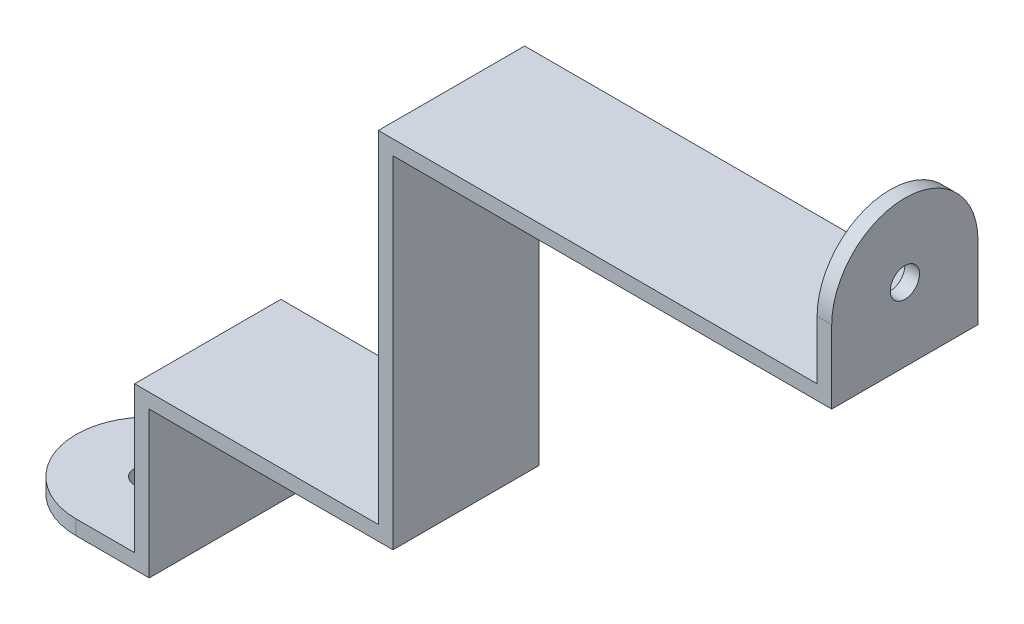
ISO-10303-21;
HEADER;
FILE_DESCRIPTION(('STEP AP214'),'2;1');
FILE_NAME('part.step','',(''),(''),'','','');
FILE_SCHEMA(('AUTOMOTIVE_DESIGN { 1 0 10303 214 1 1 1 1 }'));
ENDSEC;
DATA;
#1=APPLICATION_CONTEXT('core data for automotive mechanical design processes');
#2=APPLICATION_PROTOCOL_DEFINITION('international standard','automotive_design',2000,#1);
#3=PRODUCT_CONTEXT('',#1,'mechanical');
#4=PRODUCT('Part','Part','',(#3));
#5=PRODUCT_RELATED_PRODUCT_CATEGORY('part','',(#4));
#6=PRODUCT_DEFINITION_FORMATION('','',#4);
#7=PRODUCT_DEFINITION_CONTEXT('part definition',#1,'design');
#8=PRODUCT_DEFINITION('design','',#6,#7);
#9=PRODUCT_DEFINITION_SHAPE('','',#8);
#10=(LENGTH_UNIT() NAMED_UNIT(*) SI_UNIT(.MILLI.,.METRE.));
#11=(NAMED_UNIT(*) PLANE_ANGLE_UNIT() SI_UNIT($,.RADIAN.));
#12=(NAMED_UNIT(*) SI_UNIT($,.STERADIAN.) SOLID_ANGLE_UNIT());
#13=UNCERTAINTY_MEASURE_WITH_UNIT(LENGTH_MEASURE(1.E-05),#10,'distance_accuracy_value','');
#14=(GEOMETRIC_REPRESENTATION_CONTEXT(3) GLOBAL_UNCERTAINTY_ASSIGNED_CONTEXT((#13)) GLOBAL_UNIT_ASSIGNED_CONTEXT((#10,
#11,#12)) REPRESENTATION_CONTEXT('',''));
#15=CARTESIAN_POINT('',(0.,0.,0.));
#16=DIRECTION('',(0.,0.,1.));
#17=DIRECTION('',(1.,0.,0.));
#18=AXIS2_PLACEMENT_3D('',#15,#16,#17);
#19=CARTESIAN_POINT('',(-40.,-13.5,15.));
#20=DIRECTION('',(0.,-1.,0.));
#21=DIRECTION('',(0.,0.,-1.));
#22=AXIS2_PLACEMENT_3D('',#19,#20,#21);
#23=PLANE('',#22);
#24=CARTESIAN_POINT('',(-32.5,-13.5,7.5));
#25=DIRECTION('',(0.,1.,0.));
#26=DIRECTION('',(0.,0.,1.));
#27=AXIS2_PLACEMENT_3D('',#24,#25,#26);
#28=CIRCLE('',#27,1.5);
#29=CARTESIAN_POINT('',(-32.5,-13.5,9.));
#30=VERTEX_POINT('',#29);
#31=EDGE_CURVE('E516',#30,#30,#28,.T.);
#32=ORIENTED_EDGE('',*,*,#31,.F.);
#33=EDGE_LOOP('',(#32));
#34=FACE_BOUND('',#33,.T.);
#35=CARTESIAN_POINT('',(-32.5,-13.5,7.5));
#36=DIRECTION('',(0.,1.,0.));
#37=DIRECTION('',(0.,0.,1.));
#38=AXIS2_PLACEMENT_3D('',#35,#36,#37);
#39=CIRCLE('',#38,7.5);
#40=CARTESIAN_POINT('',(-32.5,-13.5,0.));
#41=VERTEX_POINT('',#40);
#42=CARTESIAN_POINT('',(-32.5,-13.5,15.));
#43=VERTEX_POINT('',#42);
#44=EDGE_CURVE('E200',#41,#43,#39,.T.);
#45=ORIENTED_EDGE('',*,*,#44,.T.);
#46=DIRECTION('',(-1.,0.,0.));
#47=VECTOR('',#46,1.);
#48=CARTESIAN_POINT('',(-40.,-13.5,15.));
#49=LINE('',#48,#47);
#50=CARTESIAN_POINT('',(-26.5,-13.5,15.));
#51=VERTEX_POINT('',#50);
#52=EDGE_CURVE('E203',#51,#43,#49,.T.);
#53=ORIENTED_EDGE('',*,*,#52,.F.);
#54=DIRECTION('',(0.,0.,-1.));
#55=VECTOR('',#54,1.);
#56=CARTESIAN_POINT('',(-26.5,-13.5,15.));
#57=LINE('',#56,#55);
#58=CARTESIAN_POINT('',(-26.5,-13.5,0.));
#59=VERTEX_POINT('',#58);
#60=EDGE_CURVE('E259',#51,#59,#57,.T.);
#61=ORIENTED_EDGE('',*,*,#60,.T.);
#62=DIRECTION('',(-1.,0.,0.));
#63=VECTOR('',#62,1.);
#64=CARTESIAN_POINT('',(-40.,-13.5,0.));
#65=LINE('',#64,#63);
#66=EDGE_CURVE('E205',#59,#41,#65,.T.);
#67=ORIENTED_EDGE('',*,*,#66,.T.);
#68=EDGE_LOOP('',(#45,#53,#61,#67));
#69=FACE_BOUND('',#68,.T.);
#70=ADVANCED_FACE('F98',(#34,#69),#23,.F.);
#71=CARTESIAN_POINT('',(-25.,-15.,15.));
#72=DIRECTION('',(0.,1.,0.));
#73=DIRECTION('',(-1.,0.,0.));
#74=AXIS2_PLACEMENT_3D('',#71,#72,#73);
#75=PLANE('',#74);
#76=CARTESIAN_POINT('',(-32.5,-15.,7.5));
#77=DIRECTION('',(0.,1.,0.));
#78=DIRECTION('',(-1.,0.,0.));
#79=AXIS2_PLACEMENT_3D('',#76,#77,#78);
#80=CIRCLE('',#79,1.5);
#81=CARTESIAN_POINT('',(-34.,-15.,7.5));
#82=VERTEX_POINT('',#81);
#83=EDGE_CURVE('E102',#82,#82,#80,.T.);
#84=ORIENTED_EDGE('',*,*,#83,.T.);
#85=EDGE_LOOP('',(#84));
#86=FACE_BOUND('',#85,.T.);
#87=DIRECTION('',(1.,0.,0.));
#88=VECTOR('',#87,1.);
#89=CARTESIAN_POINT('',(-25.,-15.,15.));
#90=LINE('',#89,#88);
#91=CARTESIAN_POINT('',(-32.5,-15.,15.));
#92=VERTEX_POINT('',#91);
#93=CARTESIAN_POINT('',(-25.,-15.,15.));
#94=VERTEX_POINT('',#93);
#95=EDGE_CURVE('E215',#92,#94,#90,.T.);
#96=ORIENTED_EDGE('',*,*,#95,.F.);
#97=CARTESIAN_POINT('',(-32.5,-15.,7.5));
#98=DIRECTION('',(0.,1.,0.));
#99=DIRECTION('',(-1.,0.,0.));
#100=AXIS2_PLACEMENT_3D('',#97,#98,#99);
#101=CIRCLE('',#100,7.5);
#102=CARTESIAN_POINT('',(-32.5,-15.,0.));
#103=VERTEX_POINT('',#102);
#104=EDGE_CURVE('E107',#103,#92,#101,.T.);
#105=ORIENTED_EDGE('',*,*,#104,.F.);
#106=DIRECTION('',(1.,0.,0.));
#107=VECTOR('',#106,1.);
#108=CARTESIAN_POINT('',(-25.,-15.,0.));
#109=LINE('',#108,#107);
#110=CARTESIAN_POINT('',(-25.,-15.,0.));
#111=VERTEX_POINT('',#110);
#112=EDGE_CURVE('E249',#103,#111,#109,.T.);
#113=ORIENTED_EDGE('',*,*,#112,.T.);
#114=DIRECTION('',(0.,0.,-1.));
#115=VECTOR('',#114,1.);
#116=CARTESIAN_POINT('',(-25.,-15.,15.));
#117=LINE('',#116,#115);
#118=EDGE_CURVE('E256',#94,#111,#117,.T.);
#119=ORIENTED_EDGE('',*,*,#118,.F.);
#120=EDGE_LOOP('',(#96,#105,#113,#119));
#121=FACE_BOUND('',#120,.T.);
#122=ADVANCED_FACE('F357',(#86,#121),#75,.F.);
#123=CARTESIAN_POINT('',(45.,35.,15.));
#124=DIRECTION('',(-1.,0.,0.));
#125=DIRECTION('',(0.,0.,1.));
#126=AXIS2_PLACEMENT_3D('',#123,#124,#125);
#127=PLANE('',#126);
#128=CARTESIAN_POINT('',(45.,42.5,7.5));
#129=DIRECTION('',(-1.,0.,0.));
#130=DIRECTION('',(0.,0.,1.));
#131=AXIS2_PLACEMENT_3D('',#128,#129,#130);
#132=CIRCLE('',#131,1.5);
#133=CARTESIAN_POINT('',(45.,42.5,9.));
#134=VERTEX_POINT('',#133);
#135=EDGE_CURVE('E229',#134,#134,#132,.T.);
#136=ORIENTED_EDGE('',*,*,#135,.T.);
#137=EDGE_LOOP('',(#136));
#138=FACE_BOUND('',#137,.T.);
#139=CARTESIAN_POINT('',(45.,42.5,7.5));
#140=DIRECTION('',(-1.,0.,0.));
#141=DIRECTION('',(0.,0.,1.));
#142=AXIS2_PLACEMENT_3D('',#139,#140,#141);
#143=CIRCLE('',#142,7.5);
#144=CARTESIAN_POINT('',(45.,42.5,15.));
#145=VERTEX_POINT('',#144);
#146=CARTESIAN_POINT('',(45.,42.5,0.));
#147=VERTEX_POINT('',#146);
#148=EDGE_CURVE('E122',#145,#147,#143,.T.);
#149=ORIENTED_EDGE('',*,*,#148,.F.);
#150=DIRECTION('',(0.,1.,0.));
#151=VECTOR('',#150,1.);
#152=CARTESIAN_POINT('',(45.,35.,15.));
#153=LINE('',#152,#151);
#154=CARTESIAN_POINT('',(45.,35.,15.));
#155=VERTEX_POINT('',#154);
#156=EDGE_CURVE('E292',#155,#145,#153,.T.);
#157=ORIENTED_EDGE('',*,*,#156,.F.);
#158=DIRECTION('',(0.,0.,-1.));
#159=VECTOR('',#158,1.);
#160=CARTESIAN_POINT('',(45.,35.,15.));
#161=LINE('',#160,#159);
#162=CARTESIAN_POINT('',(45.,35.,0.));
#163=VERTEX_POINT('',#162);
#164=EDGE_CURVE('E273',#155,#163,#161,.T.);
#165=ORIENTED_EDGE('',*,*,#164,.T.);
#166=DIRECTION('',(0.,1.,0.));
#167=VECTOR('',#166,1.);
#168=CARTESIAN_POINT('',(45.,35.,0.));
#169=LINE('',#168,#167);
#170=EDGE_CURVE('E233',#163,#147,#169,.T.);
#171=ORIENTED_EDGE('',*,*,#170,.T.);
#172=EDGE_LOOP('',(#149,#157,#165,#171));
#173=FACE_BOUND('',#172,.T.);
#174=ADVANCED_FACE('F341',(#138,#173),#127,.F.);
#175=CARTESIAN_POINT('',(43.5,50.,15.));
#176=DIRECTION('',(1.,0.,0.));
#177=DIRECTION('',(0.,0.,-1.));
#178=AXIS2_PLACEMENT_3D('',#175,#176,#177);
#179=PLANE('',#178);
#180=CARTESIAN_POINT('',(43.5,42.5,7.5));
#181=DIRECTION('',(-1.,0.,0.));
#182=DIRECTION('',(0.,0.,1.));
#183=AXIS2_PLACEMENT_3D('',#180,#181,#182);
#184=CIRCLE('',#183,1.5);
#185=CARTESIAN_POINT('',(43.5,42.5,9.));
#186=VERTEX_POINT('',#185);
#187=EDGE_CURVE('E325',#186,#186,#184,.T.);
#188=ORIENTED_EDGE('',*,*,#187,.F.);
#189=EDGE_LOOP('',(#188));
#190=FACE_BOUND('',#189,.T.);
#191=DIRECTION('',(0.,-1.,0.));
#192=VECTOR('',#191,1.);
#193=CARTESIAN_POINT('',(43.5,50.,15.));
#194=LINE('',#193,#192);
#195=CARTESIAN_POINT('',(43.5,42.5,15.));
#196=VERTEX_POINT('',#195);
#197=CARTESIAN_POINT('',(43.5,36.5,15.));
#198=VERTEX_POINT('',#197);
#199=EDGE_CURVE('E289',#196,#198,#194,.T.);
#200=ORIENTED_EDGE('',*,*,#199,.F.);
#201=CARTESIAN_POINT('',(43.5,42.5,7.5));
#202=DIRECTION('',(-1.,0.,0.));
#203=DIRECTION('',(0.,0.,1.));
#204=AXIS2_PLACEMENT_3D('',#201,#202,#203);
#205=CIRCLE('',#204,7.5);
#206=CARTESIAN_POINT('',(43.5,42.5,0.));
#207=VERTEX_POINT('',#206);
#208=EDGE_CURVE('E296',#196,#207,#205,.T.);
#209=ORIENTED_EDGE('',*,*,#208,.T.);
#210=DIRECTION('',(0.,-1.,0.));
#211=VECTOR('',#210,1.);
#212=CARTESIAN_POINT('',(43.5,50.,0.));
#213=LINE('',#212,#211);
#214=CARTESIAN_POINT('',(43.5,36.5,0.));
#215=VERTEX_POINT('',#214);
#216=EDGE_CURVE('E236',#207,#215,#213,.T.);
#217=ORIENTED_EDGE('',*,*,#216,.T.);
#218=DIRECTION('',(0.,0.,-1.));
#219=VECTOR('',#218,1.);
#220=CARTESIAN_POINT('',(43.5,36.5,15.));
#221=LINE('',#220,#219);
#222=EDGE_CURVE('E270',#198,#215,#221,.T.);
#223=ORIENTED_EDGE('',*,*,#222,.F.);
#224=EDGE_LOOP('',(#200,#209,#217,#223));
#225=FACE_BOUND('',#224,.T.);
#226=ADVANCED_FACE('F295',(#190,#225),#179,.F.);
#227=CARTESIAN_POINT('',(0.,0.,15.));
#228=DIRECTION('',(0.,0.,1.));
#229=DIRECTION('',(1.,0.,0.));
#230=AXIS2_PLACEMENT_3D('',#227,#228,#229);
#231=PLANE('',#230);
#232=DIRECTION('',(0.,1.,0.));
#233=VECTOR('',#232,1.);
#234=CARTESIAN_POINT('',(-32.5,-23.5,15.));
#235=LINE('',#234,#233);
#236=EDGE_CURVE('E12',#92,#43,#235,.T.);
#237=ORIENTED_EDGE('',*,*,#236,.F.);
#238=ORIENTED_EDGE('',*,*,#95,.T.);
#239=DIRECTION('',(0.,1.,0.));
#240=VECTOR('',#239,1.);
#241=CARTESIAN_POINT('',(-25.,0.,15.));
#242=LINE('',#241,#240);
#243=CARTESIAN_POINT('',(-25.,0.,15.));
#244=VERTEX_POINT('',#243);
#245=EDGE_CURVE('E217',#94,#244,#242,.T.);
#246=ORIENTED_EDGE('',*,*,#245,.T.);
#247=DIRECTION('',(1.,0.,0.));
#248=VECTOR('',#247,1.);
#249=CARTESIAN_POINT('',(0.,0.,15.));
#250=LINE('',#249,#248);
#251=CARTESIAN_POINT('',(0.,0.,15.));
#252=VERTEX_POINT('',#251);
#253=EDGE_CURVE('E253',#244,#252,#250,.T.);
#254=ORIENTED_EDGE('',*,*,#253,.T.);
#255=DIRECTION('',(0.,1.,0.));
#256=VECTOR('',#255,1.);
#257=CARTESIAN_POINT('',(0.,0.,15.));
#258=LINE('',#257,#256);
#259=CARTESIAN_POINT('',(0.,35.,15.));
#260=VERTEX_POINT('',#259);
#261=EDGE_CURVE('E332',#252,#260,#258,.T.);
#262=ORIENTED_EDGE('',*,*,#261,.T.);
#263=DIRECTION('',(1.,0.,0.));
#264=VECTOR('',#263,1.);
#265=CARTESIAN_POINT('',(0.,35.,15.));
#266=LINE('',#265,#264);
#267=EDGE_CURVE('E303',#260,#155,#266,.T.);
#268=ORIENTED_EDGE('',*,*,#267,.T.);
#269=ORIENTED_EDGE('',*,*,#156,.T.);
#270=DIRECTION('',(-1.,0.,0.));
#271=VECTOR('',#270,1.);
#272=CARTESIAN_POINT('',(53.5,42.5,15.));
#273=LINE('',#272,#271);
#274=EDGE_CURVE('E284',#145,#196,#273,.T.);
#275=ORIENTED_EDGE('',*,*,#274,.T.);
#276=ORIENTED_EDGE('',*,*,#199,.T.);
#277=DIRECTION('',(-1.,0.,0.));
#278=VECTOR('',#277,1.);
#279=CARTESIAN_POINT('',(43.5,36.5,15.));
#280=LINE('',#279,#278);
#281=CARTESIAN_POINT('',(-1.49999999999999,36.5,15.));
#282=VERTEX_POINT('',#281);
#283=EDGE_CURVE('E299',#198,#282,#280,.T.);
#284=ORIENTED_EDGE('',*,*,#283,.T.);
#285=DIRECTION('',(0.,-1.,0.));
#286=VECTOR('',#285,1.);
#287=CARTESIAN_POINT('',(-1.49999999999999,36.5,15.));
#288=LINE('',#287,#286);
#289=CARTESIAN_POINT('',(-1.49999999999999,1.49999999999999,15.));
#290=VERTEX_POINT('',#289);
#291=EDGE_CURVE('E301',#282,#290,#288,.T.);
#292=ORIENTED_EDGE('',*,*,#291,.T.);
#293=DIRECTION('',(-1.,0.,0.));
#294=VECTOR('',#293,1.);
#295=CARTESIAN_POINT('',(-1.49999999999999,1.49999999999999,15.));
#296=LINE('',#295,#294);
#297=CARTESIAN_POINT('',(-26.5,1.49999999999999,15.));
#298=VERTEX_POINT('',#297);
#299=EDGE_CURVE('E219',#290,#298,#296,.T.);
#300=ORIENTED_EDGE('',*,*,#299,.T.);
#301=DIRECTION('',(0.,-1.,0.));
#302=VECTOR('',#301,1.);
#303=CARTESIAN_POINT('',(-26.5,-13.5,15.));
#304=LINE('',#303,#302);
#305=EDGE_CURVE('E213',#298,#51,#304,.T.);
#306=ORIENTED_EDGE('',*,*,#305,.T.);
#307=ORIENTED_EDGE('',*,*,#52,.T.);
#308=EDGE_LOOP('',(#237,#238,#246,#254,#262,#268,#269,#275,#276,#284,#292,#300,#306,#307));
#309=FACE_BOUND('',#308,.T.);
#310=ADVANCED_FACE('F211',(#309),#231,.T.);
#311=CARTESIAN_POINT('',(0.,0.,0.));
#312=DIRECTION('',(0.,0.,1.));
#313=DIRECTION('',(1.,0.,0.));
#314=AXIS2_PLACEMENT_3D('',#311,#312,#313);
#315=PLANE('',#314);
#316=ORIENTED_EDGE('',*,*,#112,.F.);
#317=DIRECTION('',(0.,1.,0.));
#318=VECTOR('',#317,1.);
#319=CARTESIAN_POINT('',(-32.5,-23.5,0.));
#320=LINE('',#319,#318);
#321=EDGE_CURVE('E114',#103,#41,#320,.T.);
#322=ORIENTED_EDGE('',*,*,#321,.T.);
#323=ORIENTED_EDGE('',*,*,#66,.F.);
#324=DIRECTION('',(0.,-1.,0.));
#325=VECTOR('',#324,1.);
#326=CARTESIAN_POINT('',(-26.5,-13.5,0.));
#327=LINE('',#326,#325);
#328=CARTESIAN_POINT('',(-26.5,1.49999999999999,0.));
#329=VERTEX_POINT('',#328);
#330=EDGE_CURVE('E246',#329,#59,#327,.T.);
#331=ORIENTED_EDGE('',*,*,#330,.F.);
#332=DIRECTION('',(-1.,0.,0.));
#333=VECTOR('',#332,1.);
#334=CARTESIAN_POINT('',(-26.5,1.49999999999999,0.));
#335=LINE('',#334,#333);
#336=CARTESIAN_POINT('',(-1.49999999999999,1.49999999999999,0.));
#337=VERTEX_POINT('',#336);
#338=EDGE_CURVE('E244',#337,#329,#335,.T.);
#339=ORIENTED_EDGE('',*,*,#338,.F.);
#340=DIRECTION('',(0.,-1.,0.));
#341=VECTOR('',#340,1.);
#342=CARTESIAN_POINT('',(-1.49999999999999,35.,0.));
#343=LINE('',#342,#341);
#344=CARTESIAN_POINT('',(-1.49999999999999,36.5,0.));
#345=VERTEX_POINT('',#344);
#346=EDGE_CURVE('E241',#345,#337,#343,.T.);
#347=ORIENTED_EDGE('',*,*,#346,.F.);
#348=DIRECTION('',(-1.,0.,0.));
#349=VECTOR('',#348,1.);
#350=CARTESIAN_POINT('',(43.5,36.5,0.));
#351=LINE('',#350,#349);
#352=EDGE_CURVE('E238',#215,#345,#351,.T.);
#353=ORIENTED_EDGE('',*,*,#352,.F.);
#354=ORIENTED_EDGE('',*,*,#216,.F.);
#355=DIRECTION('',(-1.,0.,0.));
#356=VECTOR('',#355,1.);
#357=CARTESIAN_POINT('',(53.5,42.5,0.));
#358=LINE('',#357,#356);
#359=EDGE_CURVE('E282',#147,#207,#358,.T.);
#360=ORIENTED_EDGE('',*,*,#359,.F.);
#361=ORIENTED_EDGE('',*,*,#170,.F.);
#362=DIRECTION('',(1.,0.,0.));
#363=VECTOR('',#362,1.);
#364=CARTESIAN_POINT('',(0.,35.,0.));
#365=LINE('',#364,#363);
#366=CARTESIAN_POINT('',(0.,35.,0.));
#367=VERTEX_POINT('',#366);
#368=EDGE_CURVE('E231',#367,#163,#365,.T.);
#369=ORIENTED_EDGE('',*,*,#368,.F.);
#370=DIRECTION('',(0.,1.,0.));
#371=VECTOR('',#370,1.);
#372=CARTESIAN_POINT('',(0.,0.,0.));
#373=LINE('',#372,#371);
#374=CARTESIAN_POINT('',(0.,0.,0.));
#375=VERTEX_POINT('',#374);
#376=EDGE_CURVE('E228',#375,#367,#373,.T.);
#377=ORIENTED_EDGE('',*,*,#376,.F.);
#378=DIRECTION('',(1.,0.,0.));
#379=VECTOR('',#378,1.);
#380=CARTESIAN_POINT('',(0.,0.,0.));
#381=LINE('',#380,#379);
#382=CARTESIAN_POINT('',(-25.,0.,0.));
#383=VERTEX_POINT('',#382);
#384=EDGE_CURVE('E225',#383,#375,#381,.T.);
#385=ORIENTED_EDGE('',*,*,#384,.F.);
#386=DIRECTION('',(0.,1.,0.));
#387=VECTOR('',#386,1.);
#388=CARTESIAN_POINT('',(-25.,0.,0.));
#389=LINE('',#388,#387);
#390=EDGE_CURVE('E251',#111,#383,#389,.T.);
#391=ORIENTED_EDGE('',*,*,#390,.F.);
#392=EDGE_LOOP('',(#316,#322,#323,#331,#339,#347,#353,#354,#360,#361,#369,#377,#385,#391));
#393=FACE_BOUND('',#392,.T.);
#394=ADVANCED_FACE('F318',(#393),#315,.F.);
#395=CARTESIAN_POINT('',(0.,0.,15.));
#396=DIRECTION('',(0.,1.,0.));
#397=DIRECTION('',(-1.,0.,0.));
#398=AXIS2_PLACEMENT_3D('',#395,#396,#397);
#399=PLANE('',#398);
#400=ORIENTED_EDGE('',*,*,#384,.T.);
#401=DIRECTION('',(0.,0.,-1.));
#402=VECTOR('',#401,1.);
#403=CARTESIAN_POINT('',(0.,0.,15.));
#404=LINE('',#403,#402);
#405=EDGE_CURVE('E279',#252,#375,#404,.T.);
#406=ORIENTED_EDGE('',*,*,#405,.F.);
#407=ORIENTED_EDGE('',*,*,#253,.F.);
#408=DIRECTION('',(0.,0.,-1.));
#409=VECTOR('',#408,1.);
#410=CARTESIAN_POINT('',(-25.,0.,15.));
#411=LINE('',#410,#409);
#412=EDGE_CURVE('E224',#244,#383,#411,.T.);
#413=ORIENTED_EDGE('',*,*,#412,.T.);
#414=EDGE_LOOP('',(#400,#406,#407,#413));
#415=FACE_BOUND('',#414,.T.);
#416=ADVANCED_FACE('F100',(#415),#399,.F.);
#417=CARTESIAN_POINT('',(0.,0.,15.));
#418=DIRECTION('',(-1.,0.,0.));
#419=DIRECTION('',(0.,0.,1.));
#420=AXIS2_PLACEMENT_3D('',#417,#418,#419);
#421=PLANE('',#420);
#422=ORIENTED_EDGE('',*,*,#376,.T.);
#423=DIRECTION('',(0.,0.,-1.));
#424=VECTOR('',#423,1.);
#425=CARTESIAN_POINT('',(0.,35.,15.));
#426=LINE('',#425,#424);
#427=EDGE_CURVE('E276',#260,#367,#426,.T.);
#428=ORIENTED_EDGE('',*,*,#427,.F.);
#429=ORIENTED_EDGE('',*,*,#261,.F.);
#430=ORIENTED_EDGE('',*,*,#405,.T.);
#431=EDGE_LOOP('',(#422,#428,#429,#430));
#432=FACE_BOUND('',#431,.T.);
#433=ADVANCED_FACE('F387',(#432),#421,.F.);
#434=CARTESIAN_POINT('',(0.,35.,15.));
#435=DIRECTION('',(0.,1.,0.));
#436=DIRECTION('',(0.,0.,1.));
#437=AXIS2_PLACEMENT_3D('',#434,#435,#436);
#438=PLANE('',#437);
#439=ORIENTED_EDGE('',*,*,#368,.T.);
#440=ORIENTED_EDGE('',*,*,#164,.F.);
#441=ORIENTED_EDGE('',*,*,#267,.F.);
#442=ORIENTED_EDGE('',*,*,#427,.T.);
#443=EDGE_LOOP('',(#439,#440,#441,#442));
#444=FACE_BOUND('',#443,.T.);
#445=ADVANCED_FACE('F337',(#444),#438,.F.);
#446=CARTESIAN_POINT('',(43.5,36.5,15.));
#447=DIRECTION('',(0.,-1.,0.));
#448=DIRECTION('',(0.,0.,-1.));
#449=AXIS2_PLACEMENT_3D('',#446,#447,#448);
#450=PLANE('',#449);
#451=ORIENTED_EDGE('',*,*,#352,.T.);
#452=DIRECTION('',(0.,0.,-1.));
#453=VECTOR('',#452,1.);
#454=CARTESIAN_POINT('',(-1.49999999999999,36.5,15.));
#455=LINE('',#454,#453);
#456=EDGE_CURVE('E267',#282,#345,#455,.T.);
#457=ORIENTED_EDGE('',*,*,#456,.F.);
#458=ORIENTED_EDGE('',*,*,#283,.F.);
#459=ORIENTED_EDGE('',*,*,#222,.T.);
#460=EDGE_LOOP('',(#451,#457,#458,#459));
#461=FACE_BOUND('',#460,.T.);
#462=ADVANCED_FACE('F375',(#461),#450,.F.);
#463=CARTESIAN_POINT('',(-1.49999999999999,35.,15.));
#464=DIRECTION('',(1.,0.,0.));
#465=DIRECTION('',(0.,1.,0.));
#466=AXIS2_PLACEMENT_3D('',#463,#464,#465);
#467=PLANE('',#466);
#468=ORIENTED_EDGE('',*,*,#346,.T.);
#469=DIRECTION('',(0.,0.,-1.));
#470=VECTOR('',#469,1.);
#471=CARTESIAN_POINT('',(-1.49999999999999,1.49999999999999,15.));
#472=LINE('',#471,#470);
#473=EDGE_CURVE('E264',#290,#337,#472,.T.);
#474=ORIENTED_EDGE('',*,*,#473,.F.);
#475=ORIENTED_EDGE('',*,*,#291,.F.);
#476=ORIENTED_EDGE('',*,*,#456,.T.);
#477=EDGE_LOOP('',(#468,#474,#475,#476));
#478=FACE_BOUND('',#477,.T.);
#479=ADVANCED_FACE('F372',(#478),#467,.F.);
#480=CARTESIAN_POINT('',(-26.5,1.49999999999999,15.));
#481=DIRECTION('',(0.,-1.,0.));
#482=DIRECTION('',(0.,0.,-1.));
#483=AXIS2_PLACEMENT_3D('',#480,#481,#482);
#484=PLANE('',#483);
#485=ORIENTED_EDGE('',*,*,#338,.T.);
#486=DIRECTION('',(0.,0.,-1.));
#487=VECTOR('',#486,1.);
#488=CARTESIAN_POINT('',(-26.5,1.49999999999999,15.));
#489=LINE('',#488,#487);
#490=EDGE_CURVE('E261',#298,#329,#489,.T.);
#491=ORIENTED_EDGE('',*,*,#490,.F.);
#492=ORIENTED_EDGE('',*,*,#299,.F.);
#493=ORIENTED_EDGE('',*,*,#473,.T.);
#494=EDGE_LOOP('',(#485,#491,#492,#493));
#495=FACE_BOUND('',#494,.T.);
#496=ADVANCED_FACE('F312',(#495),#484,.F.);
#497=CARTESIAN_POINT('',(-26.5,-13.5,15.));
#498=DIRECTION('',(1.,0.,0.));
#499=DIRECTION('',(0.,0.,-1.));
#500=AXIS2_PLACEMENT_3D('',#497,#498,#499);
#501=PLANE('',#500);
#502=ORIENTED_EDGE('',*,*,#330,.T.);
#503=ORIENTED_EDGE('',*,*,#60,.F.);
#504=ORIENTED_EDGE('',*,*,#305,.F.);
#505=ORIENTED_EDGE('',*,*,#490,.T.);
#506=EDGE_LOOP('',(#502,#503,#504,#505));
#507=FACE_BOUND('',#506,.T.);
#508=ADVANCED_FACE('F315',(#507),#501,.F.);
#509=CARTESIAN_POINT('',(-25.,0.,15.));
#510=DIRECTION('',(-1.,0.,0.));
#511=DIRECTION('',(0.,-1.,0.));
#512=AXIS2_PLACEMENT_3D('',#509,#510,#511);
#513=PLANE('',#512);
#514=ORIENTED_EDGE('',*,*,#390,.T.);
#515=ORIENTED_EDGE('',*,*,#412,.F.);
#516=ORIENTED_EDGE('',*,*,#245,.F.);
#517=ORIENTED_EDGE('',*,*,#118,.T.);
#518=EDGE_LOOP('',(#514,#515,#516,#517));
#519=FACE_BOUND('',#518,.T.);
#520=ADVANCED_FACE('F353',(#519),#513,.F.);
#521=CARTESIAN_POINT('',(53.5,42.5,7.5));
#522=DIRECTION('',(-1.,0.,0.));
#523=DIRECTION('',(0.,0.,1.));
#524=AXIS2_PLACEMENT_3D('',#521,#522,#523);
#525=CYLINDRICAL_SURFACE('',#524,1.5);
#526=ORIENTED_EDGE('',*,*,#187,.T.);
#527=EDGE_LOOP('',(#526));
#528=FACE_BOUND('',#527,.T.);
#529=ORIENTED_EDGE('',*,*,#135,.F.);
#530=EDGE_LOOP('',(#529));
#531=FACE_BOUND('',#530,.T.);
#532=ADVANCED_FACE('F345',(#528,#531),#525,.F.);
#533=CARTESIAN_POINT('',(53.5,42.5,7.5));
#534=DIRECTION('',(-1.,0.,0.));
#535=DIRECTION('',(0.,0.,1.));
#536=AXIS2_PLACEMENT_3D('',#533,#534,#535);
#537=CYLINDRICAL_SURFACE('',#536,7.5);
#538=ORIENTED_EDGE('',*,*,#148,.T.);
#539=ORIENTED_EDGE('',*,*,#359,.T.);
#540=ORIENTED_EDGE('',*,*,#208,.F.);
#541=ORIENTED_EDGE('',*,*,#274,.F.);
#542=EDGE_LOOP('',(#538,#539,#540,#541));
#543=FACE_BOUND('',#542,.T.);
#544=ADVANCED_FACE('F343',(#543),#537,.T.);
#545=CARTESIAN_POINT('',(-32.5,-23.5,7.5));
#546=DIRECTION('',(0.,1.,0.));
#547=DIRECTION('',(0.,0.,1.));
#548=AXIS2_PLACEMENT_3D('',#545,#546,#547);
#549=CYLINDRICAL_SURFACE('',#548,7.5);
#550=ORIENTED_EDGE('',*,*,#104,.T.);
#551=ORIENTED_EDGE('',*,*,#236,.T.);
#552=ORIENTED_EDGE('',*,*,#44,.F.);
#553=ORIENTED_EDGE('',*,*,#321,.F.);
#554=EDGE_LOOP('',(#550,#551,#552,#553));
#555=FACE_BOUND('',#554,.T.);
#556=ADVANCED_FACE('F208',(#555),#549,.T.);
#557=CARTESIAN_POINT('',(-32.5,-23.5,7.5));
#558=DIRECTION('',(0.,1.,0.));
#559=DIRECTION('',(0.,0.,1.));
#560=AXIS2_PLACEMENT_3D('',#557,#558,#559);
#561=CYLINDRICAL_SURFACE('',#560,1.5);
#562=ORIENTED_EDGE('',*,*,#31,.T.);
#563=EDGE_LOOP('',(#562));
#564=FACE_BOUND('',#563,.T.);
#565=ORIENTED_EDGE('',*,*,#83,.F.);
#566=EDGE_LOOP('',(#565));
#567=FACE_BOUND('',#566,.T.);
#568=ADVANCED_FACE('F351',(#564,#567),#561,.F.);
#569=CLOSED_SHELL('',(#70,#122,#174,#226,#310,#394,#416,#433,#445,#462,#479,#496,#508,#520,#532,
#544,#556,#568));
#570=MANIFOLD_SOLID_BREP('B2',#569);
#571=ADVANCED_BREP_SHAPE_REPRESENTATION('',(#18,#570),#14);
#572=SHAPE_DEFINITION_REPRESENTATION(#9,#571);
ENDSEC;
END-ISO-10303-21;
